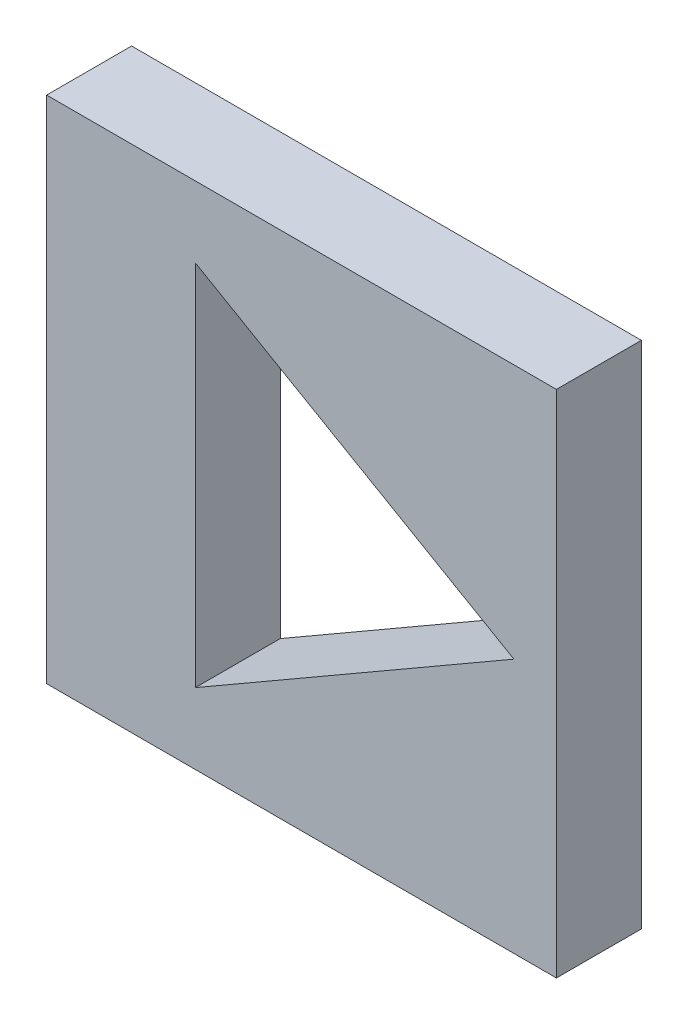
ISO-10303-21;
HEADER;
FILE_DESCRIPTION(('STEP AP214'),'2;1');
FILE_NAME('part.step','',(''),(''),'','','');
FILE_SCHEMA(('AUTOMOTIVE_DESIGN { 1 0 10303 214 1 1 1 1 }'));
ENDSEC;
DATA;
#1=APPLICATION_CONTEXT('core data for automotive mechanical design processes');
#2=APPLICATION_PROTOCOL_DEFINITION('international standard','automotive_design',2000,#1);
#3=PRODUCT_CONTEXT('',#1,'mechanical');
#4=PRODUCT('Part','Part','',(#3));
#5=PRODUCT_RELATED_PRODUCT_CATEGORY('part','',(#4));
#6=PRODUCT_DEFINITION_FORMATION('','',#4);
#7=PRODUCT_DEFINITION_CONTEXT('part definition',#1,'design');
#8=PRODUCT_DEFINITION('design','',#6,#7);
#9=PRODUCT_DEFINITION_SHAPE('','',#8);
#10=(LENGTH_UNIT() NAMED_UNIT(*) SI_UNIT(.MILLI.,.METRE.));
#11=(NAMED_UNIT(*) PLANE_ANGLE_UNIT() SI_UNIT($,.RADIAN.));
#12=(NAMED_UNIT(*) SI_UNIT($,.STERADIAN.) SOLID_ANGLE_UNIT());
#13=UNCERTAINTY_MEASURE_WITH_UNIT(LENGTH_MEASURE(1.E-05),#10,'distance_accuracy_value','');
#14=(GEOMETRIC_REPRESENTATION_CONTEXT(3) GLOBAL_UNCERTAINTY_ASSIGNED_CONTEXT((#13)) GLOBAL_UNIT_ASSIGNED_CONTEXT((#10,
#11,#12)) REPRESENTATION_CONTEXT('',''));
#15=CARTESIAN_POINT('',(0.,0.,0.));
#16=DIRECTION('',(0.,0.,1.));
#17=DIRECTION('',(1.,0.,0.));
#18=AXIS2_PLACEMENT_3D('',#15,#16,#17);
#19=CARTESIAN_POINT('',(0.,0.,10.));
#20=DIRECTION('',(0.,0.,1.));
#21=DIRECTION('',(1.,0.,0.));
#22=AXIS2_PLACEMENT_3D('',#19,#20,#21);
#23=PLANE('',#22);
#24=DIRECTION('',(0.,-1.,0.));
#25=VECTOR('',#24,1.);
#26=CARTESIAN_POINT('',(-30.,30.,10.));
#27=LINE('',#26,#25);
#28=CARTESIAN_POINT('',(-30.,30.,10.));
#29=VERTEX_POINT('',#28);
#30=CARTESIAN_POINT('',(-30.,-30.,10.));
#31=VERTEX_POINT('',#30);
#32=EDGE_CURVE('E140',#29,#31,#27,.T.);
#33=ORIENTED_EDGE('',*,*,#32,.T.);
#34=DIRECTION('',(1.,0.,0.));
#35=VECTOR('',#34,1.);
#36=CARTESIAN_POINT('',(-30.,-30.,10.));
#37=LINE('',#36,#35);
#38=CARTESIAN_POINT('',(30.,-30.,10.));
#39=VERTEX_POINT('',#38);
#40=EDGE_CURVE('E143',#31,#39,#37,.T.);
#41=ORIENTED_EDGE('',*,*,#40,.T.);
#42=DIRECTION('',(0.,-1.,0.));
#43=VECTOR('',#42,1.);
#44=CARTESIAN_POINT('',(30.,30.,10.));
#45=LINE('',#44,#43);
#46=CARTESIAN_POINT('',(30.,30.,10.));
#47=VERTEX_POINT('',#46);
#48=EDGE_CURVE('E146',#47,#39,#45,.T.);
#49=ORIENTED_EDGE('',*,*,#48,.F.);
#50=DIRECTION('',(1.,0.,0.));
#51=VECTOR('',#50,1.);
#52=CARTESIAN_POINT('',(-30.,30.,10.));
#53=LINE('',#52,#51);
#54=EDGE_CURVE('E149',#29,#47,#53,.T.);
#55=ORIENTED_EDGE('',*,*,#54,.F.);
#56=EDGE_LOOP('',(#33,#41,#49,#55));
#57=FACE_BOUND('',#56,.T.);
#58=DIRECTION('',(-0.866025403784439,0.5,0.));
#59=VECTOR('',#58,1.);
#60=CARTESIAN_POINT('',(25.,0.,10.));
#61=LINE('',#60,#59);
#62=CARTESIAN_POINT('',(25.,0.,10.));
#63=VERTEX_POINT('',#62);
#64=CARTESIAN_POINT('',(-12.5,21.650635094611,10.));
#65=VERTEX_POINT('',#64);
#66=EDGE_CURVE('E121',#63,#65,#61,.T.);
#67=ORIENTED_EDGE('',*,*,#66,.F.);
#68=DIRECTION('',(0.866025403784439,0.5,0.));
#69=VECTOR('',#68,1.);
#70=CARTESIAN_POINT('',(-12.5,-21.650635094611,10.));
#71=LINE('',#70,#69);
#72=CARTESIAN_POINT('',(-12.5,-21.650635094611,10.));
#73=VERTEX_POINT('',#72);
#74=EDGE_CURVE('E113',#73,#63,#71,.T.);
#75=ORIENTED_EDGE('',*,*,#74,.F.);
#76=DIRECTION('',(0.,-1.,0.));
#77=VECTOR('',#76,1.);
#78=CARTESIAN_POINT('',(-12.5,21.650635094611,10.));
#79=LINE('',#78,#77);
#80=EDGE_CURVE('E130',#65,#73,#79,.T.);
#81=ORIENTED_EDGE('',*,*,#80,.F.);
#82=EDGE_LOOP('',(#67,#75,#81));
#83=FACE_BOUND('',#82,.T.);
#84=ADVANCED_FACE('F54',(#57,#83),#23,.T.);
#85=CARTESIAN_POINT('',(0.,0.,0.));
#86=DIRECTION('',(0.,0.,1.));
#87=DIRECTION('',(1.,0.,0.));
#88=AXIS2_PLACEMENT_3D('',#85,#86,#87);
#89=PLANE('',#88);
#90=DIRECTION('',(0.,-1.,0.));
#91=VECTOR('',#90,1.);
#92=CARTESIAN_POINT('',(-30.,30.,0.));
#93=LINE('',#92,#91);
#94=CARTESIAN_POINT('',(-30.,30.,0.));
#95=VERTEX_POINT('',#94);
#96=CARTESIAN_POINT('',(-30.,-30.,0.));
#97=VERTEX_POINT('',#96);
#98=EDGE_CURVE('E128',#95,#97,#93,.T.);
#99=ORIENTED_EDGE('',*,*,#98,.F.);
#100=DIRECTION('',(1.,0.,0.));
#101=VECTOR('',#100,1.);
#102=CARTESIAN_POINT('',(-30.,30.,0.));
#103=LINE('',#102,#101);
#104=CARTESIAN_POINT('',(30.,30.,0.));
#105=VERTEX_POINT('',#104);
#106=EDGE_CURVE('E144',#95,#105,#103,.T.);
#107=ORIENTED_EDGE('',*,*,#106,.T.);
#108=DIRECTION('',(0.,-1.,0.));
#109=VECTOR('',#108,1.);
#110=CARTESIAN_POINT('',(30.,30.,0.));
#111=LINE('',#110,#109);
#112=CARTESIAN_POINT('',(30.,-30.,0.));
#113=VERTEX_POINT('',#112);
#114=EDGE_CURVE('E158',#105,#113,#111,.T.);
#115=ORIENTED_EDGE('',*,*,#114,.T.);
#116=DIRECTION('',(1.,0.,0.));
#117=VECTOR('',#116,1.);
#118=CARTESIAN_POINT('',(-30.,-30.,0.));
#119=LINE('',#118,#117);
#120=EDGE_CURVE('E155',#97,#113,#119,.T.);
#121=ORIENTED_EDGE('',*,*,#120,.F.);
#122=EDGE_LOOP('',(#99,#107,#115,#121));
#123=FACE_BOUND('',#122,.T.);
#124=DIRECTION('',(0.866025403784439,0.5,0.));
#125=VECTOR('',#124,1.);
#126=CARTESIAN_POINT('',(-12.5,-21.650635094611,0.));
#127=LINE('',#126,#125);
#128=CARTESIAN_POINT('',(-12.5,-21.650635094611,0.));
#129=VERTEX_POINT('',#128);
#130=CARTESIAN_POINT('',(25.,0.,0.));
#131=VERTEX_POINT('',#130);
#132=EDGE_CURVE('E77',#129,#131,#127,.T.);
#133=ORIENTED_EDGE('',*,*,#132,.T.);
#134=DIRECTION('',(-0.866025403784439,0.5,0.));
#135=VECTOR('',#134,1.);
#136=CARTESIAN_POINT('',(25.,0.,0.));
#137=LINE('',#136,#135);
#138=CARTESIAN_POINT('',(-12.5,21.650635094611,0.));
#139=VERTEX_POINT('',#138);
#140=EDGE_CURVE('E127',#131,#139,#137,.T.);
#141=ORIENTED_EDGE('',*,*,#140,.T.);
#142=DIRECTION('',(0.,-1.,0.));
#143=VECTOR('',#142,1.);
#144=CARTESIAN_POINT('',(-12.5,21.650635094611,0.));
#145=LINE('',#144,#143);
#146=EDGE_CURVE('E122',#139,#129,#145,.T.);
#147=ORIENTED_EDGE('',*,*,#146,.T.);
#148=EDGE_LOOP('',(#133,#141,#147));
#149=FACE_BOUND('',#148,.T.);
#150=ADVANCED_FACE('F175',(#123,#149),#89,.F.);
#151=CARTESIAN_POINT('',(-30.,30.,10.));
#152=DIRECTION('',(1.,0.,0.));
#153=DIRECTION('',(0.,1.,0.));
#154=AXIS2_PLACEMENT_3D('',#151,#152,#153);
#155=PLANE('',#154);
#156=ORIENTED_EDGE('',*,*,#98,.T.);
#157=DIRECTION('',(0.,0.,-1.));
#158=VECTOR('',#157,1.);
#159=CARTESIAN_POINT('',(-30.,-30.,10.));
#160=LINE('',#159,#158);
#161=EDGE_CURVE('E12',#31,#97,#160,.T.);
#162=ORIENTED_EDGE('',*,*,#161,.F.);
#163=ORIENTED_EDGE('',*,*,#32,.F.);
#164=DIRECTION('',(0.,0.,-1.));
#165=VECTOR('',#164,1.);
#166=CARTESIAN_POINT('',(-30.,30.,10.));
#167=LINE('',#166,#165);
#168=EDGE_CURVE('E152',#29,#95,#167,.T.);
#169=ORIENTED_EDGE('',*,*,#168,.T.);
#170=EDGE_LOOP('',(#156,#162,#163,#169));
#171=FACE_BOUND('',#170,.T.);
#172=ADVANCED_FACE('F56',(#171),#155,.F.);
#173=CARTESIAN_POINT('',(-30.,-30.,10.));
#174=DIRECTION('',(0.,1.,0.));
#175=DIRECTION('',(0.,0.,1.));
#176=AXIS2_PLACEMENT_3D('',#173,#174,#175);
#177=PLANE('',#176);
#178=ORIENTED_EDGE('',*,*,#120,.T.);
#179=DIRECTION('',(0.,0.,-1.));
#180=VECTOR('',#179,1.);
#181=CARTESIAN_POINT('',(30.,-30.,10.));
#182=LINE('',#181,#180);
#183=EDGE_CURVE('E62',#39,#113,#182,.T.);
#184=ORIENTED_EDGE('',*,*,#183,.F.);
#185=ORIENTED_EDGE('',*,*,#40,.F.);
#186=ORIENTED_EDGE('',*,*,#161,.T.);
#187=EDGE_LOOP('',(#178,#184,#185,#186));
#188=FACE_BOUND('',#187,.T.);
#189=ADVANCED_FACE('F171',(#188),#177,.F.);
#190=CARTESIAN_POINT('',(30.,30.,10.));
#191=DIRECTION('',(1.,0.,0.));
#192=DIRECTION('',(0.,0.,-1.));
#193=AXIS2_PLACEMENT_3D('',#190,#191,#192);
#194=PLANE('',#193);
#195=ORIENTED_EDGE('',*,*,#114,.F.);
#196=DIRECTION('',(0.,0.,-1.));
#197=VECTOR('',#196,1.);
#198=CARTESIAN_POINT('',(30.,30.,10.));
#199=LINE('',#198,#197);
#200=EDGE_CURVE('E164',#47,#105,#199,.T.);
#201=ORIENTED_EDGE('',*,*,#200,.F.);
#202=ORIENTED_EDGE('',*,*,#48,.T.);
#203=ORIENTED_EDGE('',*,*,#183,.T.);
#204=EDGE_LOOP('',(#195,#201,#202,#203));
#205=FACE_BOUND('',#204,.T.);
#206=ADVANCED_FACE('F168',(#205),#194,.T.);
#207=CARTESIAN_POINT('',(-30.,30.,10.));
#208=DIRECTION('',(0.,1.,0.));
#209=DIRECTION('',(0.,0.,1.));
#210=AXIS2_PLACEMENT_3D('',#207,#208,#209);
#211=PLANE('',#210);
#212=ORIENTED_EDGE('',*,*,#106,.F.);
#213=ORIENTED_EDGE('',*,*,#168,.F.);
#214=ORIENTED_EDGE('',*,*,#54,.T.);
#215=ORIENTED_EDGE('',*,*,#200,.T.);
#216=EDGE_LOOP('',(#212,#213,#214,#215));
#217=FACE_BOUND('',#216,.T.);
#218=ADVANCED_FACE('F179',(#217),#211,.T.);
#219=CARTESIAN_POINT('',(-12.5,-21.650635094611,10.));
#220=DIRECTION('',(-0.5,0.866025403784439,0.));
#221=DIRECTION('',(-0.866025403784439,-0.5,0.));
#222=AXIS2_PLACEMENT_3D('',#219,#220,#221);
#223=PLANE('',#222);
#224=ORIENTED_EDGE('',*,*,#132,.F.);
#225=DIRECTION('',(0.,0.,-1.));
#226=VECTOR('',#225,1.);
#227=CARTESIAN_POINT('',(-12.5,-21.650635094611,10.));
#228=LINE('',#227,#226);
#229=EDGE_CURVE('E117',#73,#129,#228,.T.);
#230=ORIENTED_EDGE('',*,*,#229,.F.);
#231=ORIENTED_EDGE('',*,*,#74,.T.);
#232=DIRECTION('',(0.,0.,-1.));
#233=VECTOR('',#232,1.);
#234=CARTESIAN_POINT('',(25.,0.,10.));
#235=LINE('',#234,#233);
#236=EDGE_CURVE('E116',#63,#131,#235,.T.);
#237=ORIENTED_EDGE('',*,*,#236,.T.);
#238=EDGE_LOOP('',(#224,#230,#231,#237));
#239=FACE_BOUND('',#238,.T.);
#240=ADVANCED_FACE('F115',(#239),#223,.T.);
#241=CARTESIAN_POINT('',(25.,0.,10.));
#242=DIRECTION('',(-0.5,-0.866025403784439,0.));
#243=DIRECTION('',(0.866025403784439,-0.5,0.));
#244=AXIS2_PLACEMENT_3D('',#241,#242,#243);
#245=PLANE('',#244);
#246=ORIENTED_EDGE('',*,*,#140,.F.);
#247=ORIENTED_EDGE('',*,*,#236,.F.);
#248=ORIENTED_EDGE('',*,*,#66,.T.);
#249=DIRECTION('',(0.,0.,-1.));
#250=VECTOR('',#249,1.);
#251=CARTESIAN_POINT('',(-12.5,21.650635094611,10.));
#252=LINE('',#251,#250);
#253=EDGE_CURVE('E69',#65,#139,#252,.T.);
#254=ORIENTED_EDGE('',*,*,#253,.T.);
#255=EDGE_LOOP('',(#246,#247,#248,#254));
#256=FACE_BOUND('',#255,.T.);
#257=ADVANCED_FACE('F125',(#256),#245,.T.);
#258=CARTESIAN_POINT('',(-12.5,21.650635094611,10.));
#259=DIRECTION('',(1.,0.,0.));
#260=DIRECTION('',(0.,1.,0.));
#261=AXIS2_PLACEMENT_3D('',#258,#259,#260);
#262=PLANE('',#261);
#263=ORIENTED_EDGE('',*,*,#146,.F.);
#264=ORIENTED_EDGE('',*,*,#253,.F.);
#265=ORIENTED_EDGE('',*,*,#80,.T.);
#266=ORIENTED_EDGE('',*,*,#229,.T.);
#267=EDGE_LOOP('',(#263,#264,#265,#266));
#268=FACE_BOUND('',#267,.T.);
#269=ADVANCED_FACE('F219',(#268),#262,.T.);
#270=CLOSED_SHELL('',(#84,#150,#172,#189,#206,#218,#240,#257,#269));
#271=MANIFOLD_SOLID_BREP('B2',#270);
#272=ADVANCED_BREP_SHAPE_REPRESENTATION('',(#18,#271),#14);
#273=SHAPE_DEFINITION_REPRESENTATION(#9,#272);
ENDSEC;
END-ISO-10303-21;
